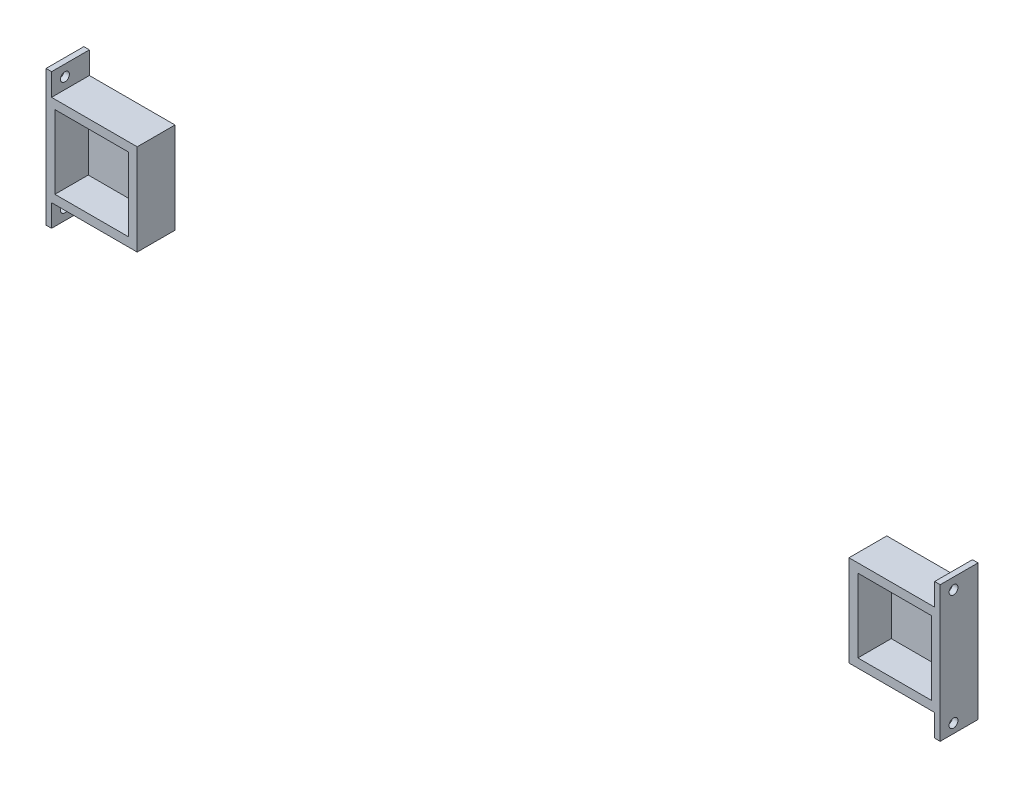
ISO-10303-21;
HEADER;
FILE_DESCRIPTION(('STEP AP214'),'2;1');
FILE_NAME('part.step','',(''),(''),'','','');
FILE_SCHEMA(('AUTOMOTIVE_DESIGN { 1 0 10303 214 1 1 1 1 }'));
ENDSEC;
DATA;
#1=APPLICATION_CONTEXT('core data for automotive mechanical design processes');
#2=APPLICATION_PROTOCOL_DEFINITION('international standard','automotive_design',2000,#1);
#3=PRODUCT_CONTEXT('',#1,'mechanical');
#4=PRODUCT('Part','Part','',(#3));
#5=PRODUCT_RELATED_PRODUCT_CATEGORY('part','',(#4));
#6=PRODUCT_DEFINITION_FORMATION('','',#4);
#7=PRODUCT_DEFINITION_CONTEXT('part definition',#1,'design');
#8=PRODUCT_DEFINITION('design','',#6,#7);
#9=PRODUCT_DEFINITION_SHAPE('','',#8);
#10=(LENGTH_UNIT() NAMED_UNIT(*) SI_UNIT(.MILLI.,.METRE.));
#11=(NAMED_UNIT(*) PLANE_ANGLE_UNIT() SI_UNIT($,.RADIAN.));
#12=(NAMED_UNIT(*) SI_UNIT($,.STERADIAN.) SOLID_ANGLE_UNIT());
#13=UNCERTAINTY_MEASURE_WITH_UNIT(LENGTH_MEASURE(1.E-05),#10,'distance_accuracy_value','');
#14=(GEOMETRIC_REPRESENTATION_CONTEXT(3) GLOBAL_UNCERTAINTY_ASSIGNED_CONTEXT((#13)) GLOBAL_UNIT_ASSIGNED_CONTEXT((#10,
#11,#12)) REPRESENTATION_CONTEXT('',''));
#15=CARTESIAN_POINT('',(0.,0.,0.));
#16=DIRECTION('',(0.,0.,1.));
#17=DIRECTION('',(1.,0.,0.));
#18=AXIS2_PLACEMENT_3D('',#15,#16,#17);
#19=CARTESIAN_POINT('',(0.,0.,19.05));
#20=DIRECTION('',(0.,0.,1.));
#21=DIRECTION('',(1.,0.,0.));
#22=AXIS2_PLACEMENT_3D('',#19,#20,#21);
#23=PLANE('',#22);
#24=DIRECTION('',(0.,-1.,0.));
#25=VECTOR('',#24,1.);
#26=CARTESIAN_POINT('',(453.39,46.9900000000001,19.05));
#27=LINE('',#26,#25);
#28=CARTESIAN_POINT('',(453.39,46.9900000000001,19.05));
#29=VERTEX_POINT('',#28);
#30=CARTESIAN_POINT('',(453.39,-5.07999999999991,19.05));
#31=VERTEX_POINT('',#30);
#32=EDGE_CURVE('E176',#29,#31,#27,.T.);
#33=ORIENTED_EDGE('',*,*,#32,.T.);
#34=DIRECTION('',(1.,0.,0.));
#35=VECTOR('',#34,1.);
#36=CARTESIAN_POINT('',(453.39,-5.07999999999991,19.05));
#37=LINE('',#36,#35);
#38=CARTESIAN_POINT('',(502.285,-5.07999999999991,19.05));
#39=VERTEX_POINT('',#38);
#40=EDGE_CURVE('E170',#31,#39,#37,.T.);
#41=ORIENTED_EDGE('',*,*,#40,.T.);
#42=DIRECTION('',(0.,-1.,0.));
#43=VECTOR('',#42,1.);
#44=CARTESIAN_POINT('',(502.285,-5.07999999999991,19.05));
#45=LINE('',#44,#43);
#46=CARTESIAN_POINT('',(502.285,-17.78,19.05));
#47=VERTEX_POINT('',#46);
#48=EDGE_CURVE('E75',#39,#47,#45,.T.);
#49=ORIENTED_EDGE('',*,*,#48,.T.);
#50=DIRECTION('',(1.,0.,0.));
#51=VECTOR('',#50,1.);
#52=CARTESIAN_POINT('',(502.285,-17.78,19.05));
#53=LINE('',#52,#51);
#54=CARTESIAN_POINT('',(505.46,-17.78,19.05));
#55=VERTEX_POINT('',#54);
#56=EDGE_CURVE('E235',#47,#55,#53,.T.);
#57=ORIENTED_EDGE('',*,*,#56,.T.);
#58=DIRECTION('',(0.,1.,0.));
#59=VECTOR('',#58,1.);
#60=CARTESIAN_POINT('',(505.46,46.9900000000001,19.05));
#61=LINE('',#60,#59);
#62=CARTESIAN_POINT('',(505.46,59.69,19.05));
#63=VERTEX_POINT('',#62);
#64=EDGE_CURVE('E166',#55,#63,#61,.T.);
#65=ORIENTED_EDGE('',*,*,#64,.T.);
#66=DIRECTION('',(1.,0.,0.));
#67=VECTOR('',#66,1.);
#68=CARTESIAN_POINT('',(502.285,59.69,19.05));
#69=LINE('',#68,#67);
#70=CARTESIAN_POINT('',(502.285,59.69,19.05));
#71=VERTEX_POINT('',#70);
#72=EDGE_CURVE('E159',#71,#63,#69,.T.);
#73=ORIENTED_EDGE('',*,*,#72,.F.);
#74=DIRECTION('',(0.,-1.,0.));
#75=VECTOR('',#74,1.);
#76=CARTESIAN_POINT('',(502.285,46.9900000000001,19.05));
#77=LINE('',#76,#75);
#78=CARTESIAN_POINT('',(502.285,46.9900000000001,19.05));
#79=VERTEX_POINT('',#78);
#80=EDGE_CURVE('E145',#71,#79,#77,.T.);
#81=ORIENTED_EDGE('',*,*,#80,.T.);
#82=DIRECTION('',(-1.,0.,0.));
#83=VECTOR('',#82,1.);
#84=CARTESIAN_POINT('',(453.39,46.9900000000001,19.05));
#85=LINE('',#84,#83);
#86=EDGE_CURVE('E156',#79,#29,#85,.T.);
#87=ORIENTED_EDGE('',*,*,#86,.T.);
#88=EDGE_LOOP('',(#33,#41,#49,#57,#65,#73,#81,#87));
#89=FACE_BOUND('',#88,.T.);
#90=DIRECTION('',(1.,0.,0.));
#91=VECTOR('',#90,1.);
#92=CARTESIAN_POINT('',(458.47,1.2490009027033E-13,19.05));
#93=LINE('',#92,#91);
#94=CARTESIAN_POINT('',(458.47,1.2490009027033E-13,19.05));
#95=VERTEX_POINT('',#94);
#96=CARTESIAN_POINT('',(500.38,1.21430643318376E-13,19.05));
#97=VERTEX_POINT('',#96);
#98=EDGE_CURVE('E217',#95,#97,#93,.T.);
#99=ORIENTED_EDGE('',*,*,#98,.F.);
#100=DIRECTION('',(0.,-1.,0.));
#101=VECTOR('',#100,1.);
#102=CARTESIAN_POINT('',(458.47,41.9100000000001,19.05));
#103=LINE('',#102,#101);
#104=CARTESIAN_POINT('',(458.47,41.9100000000001,19.05));
#105=VERTEX_POINT('',#104);
#106=EDGE_CURVE('E197',#105,#95,#103,.T.);
#107=ORIENTED_EDGE('',*,*,#106,.F.);
#108=DIRECTION('',(-1.,0.,0.));
#109=VECTOR('',#108,1.);
#110=CARTESIAN_POINT('',(458.47,41.9100000000001,19.05));
#111=LINE('',#110,#109);
#112=CARTESIAN_POINT('',(500.38,41.9100000000001,19.05));
#113=VERTEX_POINT('',#112);
#114=EDGE_CURVE('E192',#113,#105,#111,.T.);
#115=ORIENTED_EDGE('',*,*,#114,.F.);
#116=DIRECTION('',(0.,1.,0.));
#117=VECTOR('',#116,1.);
#118=CARTESIAN_POINT('',(500.38,41.9100000000001,19.05));
#119=LINE('',#118,#117);
#120=EDGE_CURVE('E213',#97,#113,#119,.T.);
#121=ORIENTED_EDGE('',*,*,#120,.F.);
#122=EDGE_LOOP('',(#99,#107,#115,#121));
#123=FACE_BOUND('',#122,.T.);
#124=ADVANCED_FACE('F51',(#89,#123),#23,.T.);
#125=CARTESIAN_POINT('',(453.39,46.9900000000001,19.05));
#126=DIRECTION('',(1.,0.,0.));
#127=DIRECTION('',(0.,1.,0.));
#128=AXIS2_PLACEMENT_3D('',#125,#126,#127);
#129=PLANE('',#128);
#130=DIRECTION('',(0.,0.,-1.));
#131=VECTOR('',#130,1.);
#132=CARTESIAN_POINT('',(453.39,46.9900000000001,19.05));
#133=LINE('',#132,#131);
#134=CARTESIAN_POINT('',(453.39,46.9900000000001,-2.54));
#135=VERTEX_POINT('',#134);
#136=EDGE_CURVE('E60',#29,#135,#133,.T.);
#137=ORIENTED_EDGE('',*,*,#136,.T.);
#138=DIRECTION('',(0.,1.,0.));
#139=VECTOR('',#138,1.);
#140=CARTESIAN_POINT('',(453.39,-5.07999999999991,-2.54));
#141=LINE('',#140,#139);
#142=CARTESIAN_POINT('',(453.39,-5.07999999999991,-2.54));
#143=VERTEX_POINT('',#142);
#144=EDGE_CURVE('E230',#143,#135,#141,.T.);
#145=ORIENTED_EDGE('',*,*,#144,.F.);
#146=DIRECTION('',(0.,0.,-1.));
#147=VECTOR('',#146,1.);
#148=CARTESIAN_POINT('',(453.39,-5.07999999999991,19.05));
#149=LINE('',#148,#147);
#150=EDGE_CURVE('E12',#31,#143,#149,.T.);
#151=ORIENTED_EDGE('',*,*,#150,.F.);
#152=ORIENTED_EDGE('',*,*,#32,.F.);
#153=EDGE_LOOP('',(#137,#145,#151,#152));
#154=FACE_BOUND('',#153,.T.);
#155=ADVANCED_FACE('F53',(#154),#129,.F.);
#156=CARTESIAN_POINT('',(453.39,-5.07999999999991,19.05));
#157=DIRECTION('',(0.,1.,0.));
#158=DIRECTION('',(0.,0.,1.));
#159=AXIS2_PLACEMENT_3D('',#156,#157,#158);
#160=PLANE('',#159);
#161=DIRECTION('',(-1.,0.,0.));
#162=VECTOR('',#161,1.);
#163=CARTESIAN_POINT('',(453.39,-5.07999999999991,-2.54));
#164=LINE('',#163,#162);
#165=CARTESIAN_POINT('',(502.285,-5.07999999999991,-2.54));
#166=VERTEX_POINT('',#165);
#167=EDGE_CURVE('E210',#166,#143,#164,.T.);
#168=ORIENTED_EDGE('',*,*,#167,.F.);
#169=DIRECTION('',(0.,0.,1.));
#170=VECTOR('',#169,1.);
#171=CARTESIAN_POINT('',(502.285,-5.07999999999991,19.05));
#172=LINE('',#171,#170);
#173=EDGE_CURVE('E239',#166,#39,#172,.T.);
#174=ORIENTED_EDGE('',*,*,#173,.T.);
#175=ORIENTED_EDGE('',*,*,#40,.F.);
#176=ORIENTED_EDGE('',*,*,#150,.T.);
#177=EDGE_LOOP('',(#168,#174,#175,#176));
#178=FACE_BOUND('',#177,.T.);
#179=ADVANCED_FACE('F298',(#178),#160,.F.);
#180=CARTESIAN_POINT('',(505.46,46.9900000000001,19.05));
#181=DIRECTION('',(-1.,0.,0.));
#182=DIRECTION('',(0.,0.,1.));
#183=AXIS2_PLACEMENT_3D('',#180,#181,#182);
#184=PLANE('',#183);
#185=ORIENTED_EDGE('',*,*,#64,.F.);
#186=DIRECTION('',(0.,0.,-1.));
#187=VECTOR('',#186,1.);
#188=CARTESIAN_POINT('',(505.46,-17.78,19.05));
#189=LINE('',#188,#187);
#190=CARTESIAN_POINT('',(505.46,-17.78,-2.54));
#191=VERTEX_POINT('',#190);
#192=EDGE_CURVE('E243',#55,#191,#189,.T.);
#193=ORIENTED_EDGE('',*,*,#192,.T.);
#194=DIRECTION('',(0.,-1.,0.));
#195=VECTOR('',#194,1.);
#196=CARTESIAN_POINT('',(505.46,-5.07999999999992,-2.54));
#197=LINE('',#196,#195);
#198=CARTESIAN_POINT('',(505.46,59.69,-2.54));
#199=VERTEX_POINT('',#198);
#200=EDGE_CURVE('E224',#199,#191,#197,.T.);
#201=ORIENTED_EDGE('',*,*,#200,.F.);
#202=DIRECTION('',(0.,0.,1.));
#203=VECTOR('',#202,1.);
#204=CARTESIAN_POINT('',(505.46,59.69,19.05));
#205=LINE('',#204,#203);
#206=EDGE_CURVE('E161',#199,#63,#205,.T.);
#207=ORIENTED_EDGE('',*,*,#206,.T.);
#208=EDGE_LOOP('',(#185,#193,#201,#207));
#209=FACE_BOUND('',#208,.T.);
#210=CARTESIAN_POINT('',(505.46,-12.5092135661895,11.43));
#211=DIRECTION('',(1.,0.,0.));
#212=DIRECTION('',(0.,0.,-1.));
#213=AXIS2_PLACEMENT_3D('',#210,#211,#212);
#214=CIRCLE('',#213,2.54);
#215=CARTESIAN_POINT('',(505.46,-12.5092135661895,8.89));
#216=VERTEX_POINT('',#215);
#217=EDGE_CURVE('E259',#216,#216,#214,.T.);
#218=ORIENTED_EDGE('',*,*,#217,.F.);
#219=EDGE_LOOP('',(#218));
#220=FACE_BOUND('',#219,.T.);
#221=CARTESIAN_POINT('',(505.46,53.34,11.43));
#222=DIRECTION('',(1.,0.,0.));
#223=DIRECTION('',(0.,0.,-1.));
#224=AXIS2_PLACEMENT_3D('',#221,#222,#223);
#225=CIRCLE('',#224,2.54);
#226=CARTESIAN_POINT('',(505.46,53.34,8.89));
#227=VERTEX_POINT('',#226);
#228=EDGE_CURVE('E281',#227,#227,#225,.T.);
#229=ORIENTED_EDGE('',*,*,#228,.F.);
#230=EDGE_LOOP('',(#229));
#231=FACE_BOUND('',#230,.T.);
#232=ADVANCED_FACE('F296',(#209,#220,#231),#184,.F.);
#233=CARTESIAN_POINT('',(453.39,46.9900000000001,19.05));
#234=DIRECTION('',(0.,-1.,0.));
#235=DIRECTION('',(0.,0.,-1.));
#236=AXIS2_PLACEMENT_3D('',#233,#234,#235);
#237=PLANE('',#236);
#238=ORIENTED_EDGE('',*,*,#86,.F.);
#239=DIRECTION('',(0.,0.,-1.));
#240=VECTOR('',#239,1.);
#241=CARTESIAN_POINT('',(502.285,46.9900000000001,19.05));
#242=LINE('',#241,#240);
#243=CARTESIAN_POINT('',(502.285,46.9900000000001,-2.54));
#244=VERTEX_POINT('',#243);
#245=EDGE_CURVE('E142',#79,#244,#242,.T.);
#246=ORIENTED_EDGE('',*,*,#245,.T.);
#247=DIRECTION('',(1.,0.,0.));
#248=VECTOR('',#247,1.);
#249=CARTESIAN_POINT('',(453.39,46.9900000000001,-2.54));
#250=LINE('',#249,#248);
#251=EDGE_CURVE('E227',#135,#244,#250,.T.);
#252=ORIENTED_EDGE('',*,*,#251,.F.);
#253=ORIENTED_EDGE('',*,*,#136,.F.);
#254=EDGE_LOOP('',(#238,#246,#252,#253));
#255=FACE_BOUND('',#254,.T.);
#256=ADVANCED_FACE('F163',(#255),#237,.F.);
#257=CARTESIAN_POINT('',(458.47,41.9100000000001,19.05));
#258=DIRECTION('',(1.,0.,0.));
#259=DIRECTION('',(0.,0.,-1.));
#260=AXIS2_PLACEMENT_3D('',#257,#258,#259);
#261=PLANE('',#260);
#262=DIRECTION('',(0.,-1.,0.));
#263=VECTOR('',#262,1.);
#264=CARTESIAN_POINT('',(458.47,41.9100000000001,0.));
#265=LINE('',#264,#263);
#266=CARTESIAN_POINT('',(458.47,41.9100000000001,0.));
#267=VERTEX_POINT('',#266);
#268=CARTESIAN_POINT('',(458.47,1.2490009027033E-13,0.));
#269=VERTEX_POINT('',#268);
#270=EDGE_CURVE('E206',#267,#269,#265,.T.);
#271=ORIENTED_EDGE('',*,*,#270,.F.);
#272=DIRECTION('',(0.,0.,-1.));
#273=VECTOR('',#272,1.);
#274=CARTESIAN_POINT('',(458.47,41.9100000000001,19.05));
#275=LINE('',#274,#273);
#276=EDGE_CURVE('E189',#105,#267,#275,.T.);
#277=ORIENTED_EDGE('',*,*,#276,.F.);
#278=ORIENTED_EDGE('',*,*,#106,.T.);
#279=DIRECTION('',(0.,0.,-1.));
#280=VECTOR('',#279,1.);
#281=CARTESIAN_POINT('',(458.47,1.2490009027033E-13,19.05));
#282=LINE('',#281,#280);
#283=EDGE_CURVE('E179',#95,#269,#282,.T.);
#284=ORIENTED_EDGE('',*,*,#283,.T.);
#285=EDGE_LOOP('',(#271,#277,#278,#284));
#286=FACE_BOUND('',#285,.T.);
#287=ADVANCED_FACE('F305',(#286),#261,.T.);
#288=CARTESIAN_POINT('',(458.47,1.2490009027033E-13,19.05));
#289=DIRECTION('',(0.,1.,0.));
#290=DIRECTION('',(-1.,0.,0.));
#291=AXIS2_PLACEMENT_3D('',#288,#289,#290);
#292=PLANE('',#291);
#293=DIRECTION('',(1.,0.,0.));
#294=VECTOR('',#293,1.);
#295=CARTESIAN_POINT('',(458.47,1.2490009027033E-13,0.));
#296=LINE('',#295,#294);
#297=CARTESIAN_POINT('',(500.38,1.21430643318376E-13,0.));
#298=VERTEX_POINT('',#297);
#299=EDGE_CURVE('E202',#269,#298,#296,.T.);
#300=ORIENTED_EDGE('',*,*,#299,.F.);
#301=ORIENTED_EDGE('',*,*,#283,.F.);
#302=ORIENTED_EDGE('',*,*,#98,.T.);
#303=DIRECTION('',(0.,0.,-1.));
#304=VECTOR('',#303,1.);
#305=CARTESIAN_POINT('',(500.38,1.21430643318376E-13,19.05));
#306=LINE('',#305,#304);
#307=EDGE_CURVE('E183',#97,#298,#306,.T.);
#308=ORIENTED_EDGE('',*,*,#307,.T.);
#309=EDGE_LOOP('',(#300,#301,#302,#308));
#310=FACE_BOUND('',#309,.T.);
#311=ADVANCED_FACE('F318',(#310),#292,.T.);
#312=CARTESIAN_POINT('',(500.38,41.9100000000001,19.05));
#313=DIRECTION('',(-1.,0.,0.));
#314=DIRECTION('',(0.,0.,1.));
#315=AXIS2_PLACEMENT_3D('',#312,#313,#314);
#316=PLANE('',#315);
#317=DIRECTION('',(0.,1.,0.));
#318=VECTOR('',#317,1.);
#319=CARTESIAN_POINT('',(500.38,41.9100000000001,0.));
#320=LINE('',#319,#318);
#321=CARTESIAN_POINT('',(500.38,41.9100000000001,0.));
#322=VERTEX_POINT('',#321);
#323=EDGE_CURVE('E198',#298,#322,#320,.T.);
#324=ORIENTED_EDGE('',*,*,#323,.F.);
#325=ORIENTED_EDGE('',*,*,#307,.F.);
#326=ORIENTED_EDGE('',*,*,#120,.T.);
#327=DIRECTION('',(0.,0.,-1.));
#328=VECTOR('',#327,1.);
#329=CARTESIAN_POINT('',(500.38,41.9100000000001,19.05));
#330=LINE('',#329,#328);
#331=EDGE_CURVE('E186',#113,#322,#330,.T.);
#332=ORIENTED_EDGE('',*,*,#331,.T.);
#333=EDGE_LOOP('',(#324,#325,#326,#332));
#334=FACE_BOUND('',#333,.T.);
#335=ADVANCED_FACE('F322',(#334),#316,.T.);
#336=CARTESIAN_POINT('',(458.47,41.9100000000001,19.05));
#337=DIRECTION('',(0.,-1.,0.));
#338=DIRECTION('',(1.,0.,0.));
#339=AXIS2_PLACEMENT_3D('',#336,#337,#338);
#340=PLANE('',#339);
#341=DIRECTION('',(-1.,0.,0.));
#342=VECTOR('',#341,1.);
#343=CARTESIAN_POINT('',(458.47,41.9100000000001,0.));
#344=LINE('',#343,#342);
#345=EDGE_CURVE('E193',#322,#267,#344,.T.);
#346=ORIENTED_EDGE('',*,*,#345,.F.);
#347=ORIENTED_EDGE('',*,*,#331,.F.);
#348=ORIENTED_EDGE('',*,*,#114,.T.);
#349=ORIENTED_EDGE('',*,*,#276,.T.);
#350=EDGE_LOOP('',(#346,#347,#348,#349));
#351=FACE_BOUND('',#350,.T.);
#352=ADVANCED_FACE('F326',(#351),#340,.T.);
#353=CARTESIAN_POINT('',(0.,0.,0.));
#354=DIRECTION('',(0.,0.,-1.));
#355=DIRECTION('',(-1.,0.,0.));
#356=AXIS2_PLACEMENT_3D('',#353,#354,#355);
#357=PLANE('',#356);
#358=ORIENTED_EDGE('',*,*,#345,.T.);
#359=ORIENTED_EDGE('',*,*,#270,.T.);
#360=ORIENTED_EDGE('',*,*,#299,.T.);
#361=ORIENTED_EDGE('',*,*,#323,.T.);
#362=EDGE_LOOP('',(#358,#359,#360,#361));
#363=FACE_BOUND('',#362,.T.);
#364=ADVANCED_FACE('F330',(#363),#357,.F.);
#365=CARTESIAN_POINT('',(0.,0.,-2.54));
#366=DIRECTION('',(0.,0.,-1.));
#367=DIRECTION('',(-1.,0.,0.));
#368=AXIS2_PLACEMENT_3D('',#365,#366,#367);
#369=PLANE('',#368);
#370=ORIENTED_EDGE('',*,*,#144,.T.);
#371=ORIENTED_EDGE('',*,*,#251,.T.);
#372=DIRECTION('',(0.,1.,0.));
#373=VECTOR('',#372,1.);
#374=CARTESIAN_POINT('',(502.285,46.9900000000001,-2.54));
#375=LINE('',#374,#373);
#376=CARTESIAN_POINT('',(502.285,59.69,-2.54));
#377=VERTEX_POINT('',#376);
#378=EDGE_CURVE('E67',#244,#377,#375,.T.);
#379=ORIENTED_EDGE('',*,*,#378,.T.);
#380=DIRECTION('',(1.,0.,0.));
#381=VECTOR('',#380,1.);
#382=CARTESIAN_POINT('',(502.285,59.69,-2.54));
#383=LINE('',#382,#381);
#384=EDGE_CURVE('E266',#377,#199,#383,.T.);
#385=ORIENTED_EDGE('',*,*,#384,.T.);
#386=ORIENTED_EDGE('',*,*,#200,.T.);
#387=DIRECTION('',(1.,0.,0.));
#388=VECTOR('',#387,1.);
#389=CARTESIAN_POINT('',(502.285,-17.78,-2.54));
#390=LINE('',#389,#388);
#391=CARTESIAN_POINT('',(502.285,-17.78,-2.54));
#392=VERTEX_POINT('',#391);
#393=EDGE_CURVE('E234',#392,#191,#390,.T.);
#394=ORIENTED_EDGE('',*,*,#393,.F.);
#395=DIRECTION('',(0.,1.,0.));
#396=VECTOR('',#395,1.);
#397=CARTESIAN_POINT('',(502.285,-5.07999999999991,-2.54));
#398=LINE('',#397,#396);
#399=EDGE_CURVE('E250',#392,#166,#398,.T.);
#400=ORIENTED_EDGE('',*,*,#399,.T.);
#401=ORIENTED_EDGE('',*,*,#167,.T.);
#402=EDGE_LOOP('',(#370,#371,#379,#385,#386,#394,#400,#401));
#403=FACE_BOUND('',#402,.T.);
#404=ADVANCED_FACE('F334',(#403),#369,.T.);
#405=CARTESIAN_POINT('',(502.285,-17.78,19.05));
#406=DIRECTION('',(0.,-1.,0.));
#407=DIRECTION('',(0.,0.,-1.));
#408=AXIS2_PLACEMENT_3D('',#405,#406,#407);
#409=PLANE('',#408);
#410=ORIENTED_EDGE('',*,*,#192,.F.);
#411=ORIENTED_EDGE('',*,*,#56,.F.);
#412=DIRECTION('',(0.,0.,-1.));
#413=VECTOR('',#412,1.);
#414=CARTESIAN_POINT('',(502.285,-17.78,19.05));
#415=LINE('',#414,#413);
#416=EDGE_CURVE('E253',#47,#392,#415,.T.);
#417=ORIENTED_EDGE('',*,*,#416,.T.);
#418=ORIENTED_EDGE('',*,*,#393,.T.);
#419=EDGE_LOOP('',(#410,#411,#417,#418));
#420=FACE_BOUND('',#419,.T.);
#421=ADVANCED_FACE('F338',(#420),#409,.T.);
#422=CARTESIAN_POINT('',(502.285,0.,0.));
#423=DIRECTION('',(1.,0.,0.));
#424=DIRECTION('',(0.,0.,-1.));
#425=AXIS2_PLACEMENT_3D('',#422,#423,#424);
#426=PLANE('',#425);
#427=CARTESIAN_POINT('',(502.285,-12.5092135661895,11.43));
#428=DIRECTION('',(1.,0.,0.));
#429=DIRECTION('',(0.,0.,-1.));
#430=AXIS2_PLACEMENT_3D('',#427,#428,#429);
#431=CIRCLE('',#430,2.54);
#432=CARTESIAN_POINT('',(502.285,-12.5092135661895,8.89));
#433=VERTEX_POINT('',#432);
#434=EDGE_CURVE('E247',#433,#433,#431,.T.);
#435=ORIENTED_EDGE('',*,*,#434,.T.);
#436=EDGE_LOOP('',(#435));
#437=FACE_BOUND('',#436,.T.);
#438=ORIENTED_EDGE('',*,*,#48,.F.);
#439=ORIENTED_EDGE('',*,*,#173,.F.);
#440=ORIENTED_EDGE('',*,*,#399,.F.);
#441=ORIENTED_EDGE('',*,*,#416,.F.);
#442=EDGE_LOOP('',(#438,#439,#440,#441));
#443=FACE_BOUND('',#442,.T.);
#444=ADVANCED_FACE('F342',(#437,#443),#426,.F.);
#445=CARTESIAN_POINT('',(502.285,-12.5092135661895,11.43));
#446=DIRECTION('',(1.,0.,0.));
#447=DIRECTION('',(0.,0.,-1.));
#448=AXIS2_PLACEMENT_3D('',#445,#446,#447);
#449=CYLINDRICAL_SURFACE('',#448,2.54);
#450=ORIENTED_EDGE('',*,*,#434,.F.);
#451=EDGE_LOOP('',(#450));
#452=FACE_BOUND('',#451,.T.);
#453=ORIENTED_EDGE('',*,*,#217,.T.);
#454=EDGE_LOOP('',(#453));
#455=FACE_BOUND('',#454,.T.);
#456=ADVANCED_FACE('F346',(#452,#455),#449,.F.);
#457=CARTESIAN_POINT('',(502.285,59.69,19.05));
#458=DIRECTION('',(0.,1.,0.));
#459=DIRECTION('',(0.,0.,1.));
#460=AXIS2_PLACEMENT_3D('',#457,#458,#459);
#461=PLANE('',#460);
#462=ORIENTED_EDGE('',*,*,#206,.F.);
#463=ORIENTED_EDGE('',*,*,#384,.F.);
#464=DIRECTION('',(0.,0.,1.));
#465=VECTOR('',#464,1.);
#466=CARTESIAN_POINT('',(502.285,59.69,19.05));
#467=LINE('',#466,#465);
#468=EDGE_CURVE('E270',#377,#71,#467,.T.);
#469=ORIENTED_EDGE('',*,*,#468,.T.);
#470=ORIENTED_EDGE('',*,*,#72,.T.);
#471=EDGE_LOOP('',(#462,#463,#469,#470));
#472=FACE_BOUND('',#471,.T.);
#473=ADVANCED_FACE('F350',(#472),#461,.T.);
#474=CARTESIAN_POINT('',(502.285,0.,0.));
#475=DIRECTION('',(-1.,0.,0.));
#476=DIRECTION('',(0.,0.,1.));
#477=AXIS2_PLACEMENT_3D('',#474,#475,#476);
#478=PLANE('',#477);
#479=CARTESIAN_POINT('',(502.285,53.34,11.43));
#480=DIRECTION('',(1.,0.,0.));
#481=DIRECTION('',(0.,0.,-1.));
#482=AXIS2_PLACEMENT_3D('',#479,#480,#481);
#483=CIRCLE('',#482,2.54);
#484=CARTESIAN_POINT('',(502.285,53.34,8.89));
#485=VERTEX_POINT('',#484);
#486=EDGE_CURVE('E276',#485,#485,#483,.T.);
#487=ORIENTED_EDGE('',*,*,#486,.T.);
#488=EDGE_LOOP('',(#487));
#489=FACE_BOUND('',#488,.T.);
#490=ORIENTED_EDGE('',*,*,#80,.F.);
#491=ORIENTED_EDGE('',*,*,#468,.F.);
#492=ORIENTED_EDGE('',*,*,#378,.F.);
#493=ORIENTED_EDGE('',*,*,#245,.F.);
#494=EDGE_LOOP('',(#490,#491,#492,#493));
#495=FACE_BOUND('',#494,.T.);
#496=ADVANCED_FACE('F144',(#489,#495),#478,.T.);
#497=CARTESIAN_POINT('',(502.285,53.34,11.43));
#498=DIRECTION('',(1.,0.,0.));
#499=DIRECTION('',(0.,0.,-1.));
#500=AXIS2_PLACEMENT_3D('',#497,#498,#499);
#501=CYLINDRICAL_SURFACE('',#500,2.54);
#502=ORIENTED_EDGE('',*,*,#486,.F.);
#503=EDGE_LOOP('',(#502));
#504=FACE_BOUND('',#503,.T.);
#505=ORIENTED_EDGE('',*,*,#228,.T.);
#506=EDGE_LOOP('',(#505));
#507=FACE_BOUND('',#506,.T.);
#508=ADVANCED_FACE('F290',(#504,#507),#501,.F.);
#509=CLOSED_SHELL('',(#124,#155,#179,#232,#256,#287,#311,#335,#352,#364,#404,#421,#444,#456,
#473,#496,#508));
#510=MANIFOLD_SOLID_BREP('B2',#509);
#511=CARTESIAN_POINT('',(0.,0.,19.05));
#512=DIRECTION('',(0.,0.,1.));
#513=DIRECTION('',(1.,0.,0.));
#514=AXIS2_PLACEMENT_3D('',#511,#512,#513);
#515=PLANE('',#514);
#516=DIRECTION('',(0.,-1.,0.));
#517=VECTOR('',#516,1.);
#518=CARTESIAN_POINT('',(-5.08,46.99,19.05));
#519=LINE('',#518,#517);
#520=CARTESIAN_POINT('',(-5.08,59.69,19.05));
#521=VERTEX_POINT('',#520);
#522=CARTESIAN_POINT('',(-5.07999999999999,-17.78,19.05));
#523=VERTEX_POINT('',#522);
#524=EDGE_CURVE('E690',#521,#523,#519,.T.);
#525=ORIENTED_EDGE('',*,*,#524,.T.);
#526=DIRECTION('',(-1.,0.,0.));
#527=VECTOR('',#526,1.);
#528=CARTESIAN_POINT('',(-1.90499999999999,-17.78,19.05));
#529=LINE('',#528,#527);
#530=CARTESIAN_POINT('',(-1.90499999999999,-17.78,19.05));
#531=VERTEX_POINT('',#530);
#532=EDGE_CURVE('E645',#531,#523,#529,.T.);
#533=ORIENTED_EDGE('',*,*,#532,.F.);
#534=DIRECTION('',(0.,1.,0.));
#535=VECTOR('',#534,1.);
#536=CARTESIAN_POINT('',(-1.90499999999999,-5.08,19.05));
#537=LINE('',#536,#535);
#538=CARTESIAN_POINT('',(-1.90499999999999,-5.08,19.05));
#539=VERTEX_POINT('',#538);
#540=EDGE_CURVE('E633',#531,#539,#537,.T.);
#541=ORIENTED_EDGE('',*,*,#540,.T.);
#542=DIRECTION('',(1.,0.,0.));
#543=VECTOR('',#542,1.);
#544=CARTESIAN_POINT('',(-5.07999999999999,-5.08,19.05));
#545=LINE('',#544,#543);
#546=CARTESIAN_POINT('',(46.99,-5.08,19.05));
#547=VERTEX_POINT('',#546);
#548=EDGE_CURVE('E692',#539,#547,#545,.T.);
#549=ORIENTED_EDGE('',*,*,#548,.T.);
#550=DIRECTION('',(0.,1.,0.));
#551=VECTOR('',#550,1.);
#552=CARTESIAN_POINT('',(46.99,46.99,19.05));
#553=LINE('',#552,#551);
#554=CARTESIAN_POINT('',(46.99,46.99,19.05));
#555=VERTEX_POINT('',#554);
#556=EDGE_CURVE('E694',#547,#555,#553,.T.);
#557=ORIENTED_EDGE('',*,*,#556,.T.);
#558=DIRECTION('',(-1.,0.,0.));
#559=VECTOR('',#558,1.);
#560=CARTESIAN_POINT('',(-5.08,46.99,19.05));
#561=LINE('',#560,#559);
#562=CARTESIAN_POINT('',(-1.905,46.99,19.05));
#563=VERTEX_POINT('',#562);
#564=EDGE_CURVE('E615',#555,#563,#561,.T.);
#565=ORIENTED_EDGE('',*,*,#564,.T.);
#566=DIRECTION('',(0.,1.,0.));
#567=VECTOR('',#566,1.);
#568=CARTESIAN_POINT('',(-1.905,46.99,19.05));
#569=LINE('',#568,#567);
#570=CARTESIAN_POINT('',(-1.905,59.69,19.05));
#571=VERTEX_POINT('',#570);
#572=EDGE_CURVE('E521',#563,#571,#569,.T.);
#573=ORIENTED_EDGE('',*,*,#572,.T.);
#574=DIRECTION('',(-1.,0.,0.));
#575=VECTOR('',#574,1.);
#576=CARTESIAN_POINT('',(-1.905,59.69,19.05));
#577=LINE('',#576,#575);
#578=EDGE_CURVE('E598',#571,#521,#577,.T.);
#579=ORIENTED_EDGE('',*,*,#578,.T.);
#580=EDGE_LOOP('',(#525,#533,#541,#549,#557,#565,#573,#579));
#581=FACE_BOUND('',#580,.T.);
#582=DIRECTION('',(1.,0.,0.));
#583=VECTOR('',#582,1.);
#584=CARTESIAN_POINT('',(0.,0.,19.05));
#585=LINE('',#584,#583);
#586=CARTESIAN_POINT('',(0.,0.,19.05));
#587=VERTEX_POINT('',#586);
#588=CARTESIAN_POINT('',(41.91,0.,19.05));
#589=VERTEX_POINT('',#588);
#590=EDGE_CURVE('E663',#587,#589,#585,.T.);
#591=ORIENTED_EDGE('',*,*,#590,.F.);
#592=DIRECTION('',(0.,-1.,0.));
#593=VECTOR('',#592,1.);
#594=CARTESIAN_POINT('',(0.,0.,19.05));
#595=LINE('',#594,#593);
#596=CARTESIAN_POINT('',(0.,41.91,19.05));
#597=VERTEX_POINT('',#596);
#598=EDGE_CURVE('E661',#597,#587,#595,.T.);
#599=ORIENTED_EDGE('',*,*,#598,.F.);
#600=DIRECTION('',(-1.,0.,0.));
#601=VECTOR('',#600,1.);
#602=CARTESIAN_POINT('',(0.,41.91,19.05));
#603=LINE('',#602,#601);
#604=CARTESIAN_POINT('',(41.91,41.91,19.05));
#605=VERTEX_POINT('',#604);
#606=EDGE_CURVE('E669',#605,#597,#603,.T.);
#607=ORIENTED_EDGE('',*,*,#606,.F.);
#608=DIRECTION('',(0.,1.,0.));
#609=VECTOR('',#608,1.);
#610=CARTESIAN_POINT('',(41.91,0.,19.05));
#611=LINE('',#610,#609);
#612=EDGE_CURVE('E666',#589,#605,#611,.T.);
#613=ORIENTED_EDGE('',*,*,#612,.F.);
#614=EDGE_LOOP('',(#591,#599,#607,#613));
#615=FACE_BOUND('',#614,.T.);
#616=ADVANCED_FACE('F506',(#581,#615),#515,.T.);
#617=CARTESIAN_POINT('',(-5.08,46.99,19.05));
#618=DIRECTION('',(1.,0.,0.));
#619=DIRECTION('',(0.,1.,0.));
#620=AXIS2_PLACEMENT_3D('',#617,#618,#619);
#621=PLANE('',#620);
#622=ORIENTED_EDGE('',*,*,#524,.F.);
#623=DIRECTION('',(0.,0.,-1.));
#624=VECTOR('',#623,1.);
#625=CARTESIAN_POINT('',(-5.08,59.69,19.05));
#626=LINE('',#625,#624);
#627=CARTESIAN_POINT('',(-5.08,59.69,-2.54));
#628=VERTEX_POINT('',#627);
#629=EDGE_CURVE('E603',#521,#628,#626,.T.);
#630=ORIENTED_EDGE('',*,*,#629,.T.);
#631=DIRECTION('',(0.,1.,0.));
#632=VECTOR('',#631,1.);
#633=CARTESIAN_POINT('',(-5.07999999999999,-5.08,-2.54));
#634=LINE('',#633,#632);
#635=CARTESIAN_POINT('',(-5.07999999999999,-17.78,-2.54));
#636=VERTEX_POINT('',#635);
#637=EDGE_CURVE('E648',#636,#628,#634,.T.);
#638=ORIENTED_EDGE('',*,*,#637,.F.);
#639=DIRECTION('',(0.,0.,1.));
#640=VECTOR('',#639,1.);
#641=CARTESIAN_POINT('',(-5.07999999999999,-17.78,19.05));
#642=LINE('',#641,#640);
#643=EDGE_CURVE('E630',#636,#523,#642,.T.);
#644=ORIENTED_EDGE('',*,*,#643,.T.);
#645=EDGE_LOOP('',(#622,#630,#638,#644));
#646=FACE_BOUND('',#645,.T.);
#647=CARTESIAN_POINT('',(-5.07999999999999,-11.43,11.43));
#648=DIRECTION('',(-1.,0.,0.));
#649=DIRECTION('',(0.,-1.,0.));
#650=AXIS2_PLACEMENT_3D('',#647,#648,#649);
#651=CIRCLE('',#650,2.54);
#652=CARTESIAN_POINT('',(-5.07999999999999,-13.97,11.43));
#653=VERTEX_POINT('',#652);
#654=EDGE_CURVE('E625',#653,#653,#651,.T.);
#655=ORIENTED_EDGE('',*,*,#654,.F.);
#656=EDGE_LOOP('',(#655));
#657=FACE_BOUND('',#656,.T.);
#658=CARTESIAN_POINT('',(-5.08,53.34,11.43));
#659=DIRECTION('',(-1.,0.,0.));
#660=DIRECTION('',(0.,-1.,0.));
#661=AXIS2_PLACEMENT_3D('',#658,#659,#660);
#662=CIRCLE('',#661,2.54);
#663=CARTESIAN_POINT('',(-5.08,50.8,11.43));
#664=VERTEX_POINT('',#663);
#665=EDGE_CURVE('E620',#664,#664,#662,.T.);
#666=ORIENTED_EDGE('',*,*,#665,.F.);
#667=EDGE_LOOP('',(#666));
#668=FACE_BOUND('',#667,.T.);
#669=ADVANCED_FACE('F508',(#646,#657,#668),#621,.F.);
#670=CARTESIAN_POINT('',(-5.07999999999999,-5.08,19.05));
#671=DIRECTION('',(0.,1.,0.));
#672=DIRECTION('',(0.,0.,1.));
#673=AXIS2_PLACEMENT_3D('',#670,#671,#672);
#674=PLANE('',#673);
#675=ORIENTED_EDGE('',*,*,#548,.F.);
#676=DIRECTION('',(0.,0.,-1.));
#677=VECTOR('',#676,1.);
#678=CARTESIAN_POINT('',(-1.90499999999999,-5.08,19.05));
#679=LINE('',#678,#677);
#680=CARTESIAN_POINT('',(-1.90499999999999,-5.08,-2.54));
#681=VERTEX_POINT('',#680);
#682=EDGE_CURVE('E636',#539,#681,#679,.T.);
#683=ORIENTED_EDGE('',*,*,#682,.T.);
#684=DIRECTION('',(-1.,0.,0.));
#685=VECTOR('',#684,1.);
#686=CARTESIAN_POINT('',(-5.07999999999999,-5.08,-2.54));
#687=LINE('',#686,#685);
#688=CARTESIAN_POINT('',(46.99,-5.08,-2.54));
#689=VERTEX_POINT('',#688);
#690=EDGE_CURVE('E657',#689,#681,#687,.T.);
#691=ORIENTED_EDGE('',*,*,#690,.F.);
#692=DIRECTION('',(0.,0.,-1.));
#693=VECTOR('',#692,1.);
#694=CARTESIAN_POINT('',(46.99,-5.08,19.05));
#695=LINE('',#694,#693);
#696=EDGE_CURVE('E49',#547,#689,#695,.T.);
#697=ORIENTED_EDGE('',*,*,#696,.F.);
#698=EDGE_LOOP('',(#675,#683,#691,#697));
#699=FACE_BOUND('',#698,.T.);
#700=ADVANCED_FACE('F711',(#699),#674,.F.);
#701=CARTESIAN_POINT('',(46.99,46.99,19.05));
#702=DIRECTION('',(-1.,0.,0.));
#703=DIRECTION('',(0.,-1.,0.));
#704=AXIS2_PLACEMENT_3D('',#701,#702,#703);
#705=PLANE('',#704);
#706=ORIENTED_EDGE('',*,*,#696,.T.);
#707=DIRECTION('',(0.,-1.,0.));
#708=VECTOR('',#707,1.);
#709=CARTESIAN_POINT('',(46.99,-5.08,-2.54));
#710=LINE('',#709,#708);
#711=CARTESIAN_POINT('',(46.99,46.99,-2.54));
#712=VERTEX_POINT('',#711);
#713=EDGE_CURVE('E654',#712,#689,#710,.T.);
#714=ORIENTED_EDGE('',*,*,#713,.F.);
#715=DIRECTION('',(0.,0.,-1.));
#716=VECTOR('',#715,1.);
#717=CARTESIAN_POINT('',(46.99,46.99,19.05));
#718=LINE('',#717,#716);
#719=EDGE_CURVE('E514',#555,#712,#718,.T.);
#720=ORIENTED_EDGE('',*,*,#719,.F.);
#721=ORIENTED_EDGE('',*,*,#556,.F.);
#722=EDGE_LOOP('',(#706,#714,#720,#721));
#723=FACE_BOUND('',#722,.T.);
#724=ADVANCED_FACE('F704',(#723),#705,.F.);
#725=CARTESIAN_POINT('',(-5.08,46.99,19.05));
#726=DIRECTION('',(0.,-1.,0.));
#727=DIRECTION('',(0.,0.,-1.));
#728=AXIS2_PLACEMENT_3D('',#725,#726,#727);
#729=PLANE('',#728);
#730=DIRECTION('',(1.,0.,0.));
#731=VECTOR('',#730,1.);
#732=CARTESIAN_POINT('',(-5.07999999999999,46.99,-2.54));
#733=LINE('',#732,#731);
#734=CARTESIAN_POINT('',(-1.905,46.99,-2.54));
#735=VERTEX_POINT('',#734);
#736=EDGE_CURVE('E652',#735,#712,#733,.T.);
#737=ORIENTED_EDGE('',*,*,#736,.F.);
#738=DIRECTION('',(0.,0.,1.));
#739=VECTOR('',#738,1.);
#740=CARTESIAN_POINT('',(-1.905,46.99,19.05));
#741=LINE('',#740,#739);
#742=EDGE_CURVE('E606',#735,#563,#741,.T.);
#743=ORIENTED_EDGE('',*,*,#742,.T.);
#744=ORIENTED_EDGE('',*,*,#564,.F.);
#745=ORIENTED_EDGE('',*,*,#719,.T.);
#746=EDGE_LOOP('',(#737,#743,#744,#745));
#747=FACE_BOUND('',#746,.T.);
#748=ADVANCED_FACE('F701',(#747),#729,.F.);
#749=CARTESIAN_POINT('',(0.,0.,19.05));
#750=DIRECTION('',(1.,0.,0.));
#751=DIRECTION('',(0.,0.,-1.));
#752=AXIS2_PLACEMENT_3D('',#749,#750,#751);
#753=PLANE('',#752);
#754=DIRECTION('',(0.,-1.,0.));
#755=VECTOR('',#754,1.);
#756=CARTESIAN_POINT('',(0.,0.,0.));
#757=LINE('',#756,#755);
#758=CARTESIAN_POINT('',(0.,41.91,0.));
#759=VERTEX_POINT('',#758);
#760=CARTESIAN_POINT('',(0.,0.,0.));
#761=VERTEX_POINT('',#760);
#762=EDGE_CURVE('E660',#759,#761,#757,.T.);
#763=ORIENTED_EDGE('',*,*,#762,.F.);
#764=DIRECTION('',(0.,0.,-1.));
#765=VECTOR('',#764,1.);
#766=CARTESIAN_POINT('',(0.,41.91,19.05));
#767=LINE('',#766,#765);
#768=EDGE_CURVE('E671',#597,#759,#767,.T.);
#769=ORIENTED_EDGE('',*,*,#768,.F.);
#770=ORIENTED_EDGE('',*,*,#598,.T.);
#771=DIRECTION('',(0.,0.,-1.));
#772=VECTOR('',#771,1.);
#773=CARTESIAN_POINT('',(0.,0.,19.05));
#774=LINE('',#773,#772);
#775=EDGE_CURVE('E687',#587,#761,#774,.T.);
#776=ORIENTED_EDGE('',*,*,#775,.T.);
#777=EDGE_LOOP('',(#763,#769,#770,#776));
#778=FACE_BOUND('',#777,.T.);
#779=ADVANCED_FACE('F742',(#778),#753,.T.);
#780=CARTESIAN_POINT('',(0.,0.,19.05));
#781=DIRECTION('',(0.,1.,0.));
#782=DIRECTION('',(0.,0.,1.));
#783=AXIS2_PLACEMENT_3D('',#780,#781,#782);
#784=PLANE('',#783);
#785=DIRECTION('',(1.,0.,0.));
#786=VECTOR('',#785,1.);
#787=CARTESIAN_POINT('',(0.,0.,0.));
#788=LINE('',#787,#786);
#789=CARTESIAN_POINT('',(41.91,0.,0.));
#790=VERTEX_POINT('',#789);
#791=EDGE_CURVE('E674',#761,#790,#788,.T.);
#792=ORIENTED_EDGE('',*,*,#791,.F.);
#793=ORIENTED_EDGE('',*,*,#775,.F.);
#794=ORIENTED_EDGE('',*,*,#590,.T.);
#795=DIRECTION('',(0.,0.,-1.));
#796=VECTOR('',#795,1.);
#797=CARTESIAN_POINT('',(41.91,0.,19.05));
#798=LINE('',#797,#796);
#799=EDGE_CURVE('E685',#589,#790,#798,.T.);
#800=ORIENTED_EDGE('',*,*,#799,.T.);
#801=EDGE_LOOP('',(#792,#793,#794,#800));
#802=FACE_BOUND('',#801,.T.);
#803=ADVANCED_FACE('F767',(#802),#784,.T.);
#804=CARTESIAN_POINT('',(41.91,0.,19.05));
#805=DIRECTION('',(-1.,0.,0.));
#806=DIRECTION('',(0.,0.,1.));
#807=AXIS2_PLACEMENT_3D('',#804,#805,#806);
#808=PLANE('',#807);
#809=DIRECTION('',(0.,1.,0.));
#810=VECTOR('',#809,1.);
#811=CARTESIAN_POINT('',(41.91,0.,0.));
#812=LINE('',#811,#810);
#813=CARTESIAN_POINT('',(41.91,41.91,0.));
#814=VERTEX_POINT('',#813);
#815=EDGE_CURVE('E677',#790,#814,#812,.T.);
#816=ORIENTED_EDGE('',*,*,#815,.F.);
#817=ORIENTED_EDGE('',*,*,#799,.F.);
#818=ORIENTED_EDGE('',*,*,#612,.T.);
#819=DIRECTION('',(0.,0.,-1.));
#820=VECTOR('',#819,1.);
#821=CARTESIAN_POINT('',(41.91,41.91,19.05));
#822=LINE('',#821,#820);
#823=EDGE_CURVE('E683',#605,#814,#822,.T.);
#824=ORIENTED_EDGE('',*,*,#823,.T.);
#825=EDGE_LOOP('',(#816,#817,#818,#824));
#826=FACE_BOUND('',#825,.T.);
#827=ADVANCED_FACE('F774',(#826),#808,.T.);
#828=CARTESIAN_POINT('',(0.,41.91,19.05));
#829=DIRECTION('',(0.,-1.,0.));
#830=DIRECTION('',(0.,0.,-1.));
#831=AXIS2_PLACEMENT_3D('',#828,#829,#830);
#832=PLANE('',#831);
#833=DIRECTION('',(-1.,0.,0.));
#834=VECTOR('',#833,1.);
#835=CARTESIAN_POINT('',(0.,41.91,0.));
#836=LINE('',#835,#834);
#837=EDGE_CURVE('E664',#814,#759,#836,.T.);
#838=ORIENTED_EDGE('',*,*,#837,.F.);
#839=ORIENTED_EDGE('',*,*,#823,.F.);
#840=ORIENTED_EDGE('',*,*,#606,.T.);
#841=ORIENTED_EDGE('',*,*,#768,.T.);
#842=EDGE_LOOP('',(#838,#839,#840,#841));
#843=FACE_BOUND('',#842,.T.);
#844=ADVANCED_FACE('F781',(#843),#832,.T.);
#845=CARTESIAN_POINT('',(0.,0.,0.));
#846=DIRECTION('',(0.,0.,-1.));
#847=DIRECTION('',(-1.,0.,0.));
#848=AXIS2_PLACEMENT_3D('',#845,#846,#847);
#849=PLANE('',#848);
#850=ORIENTED_EDGE('',*,*,#837,.T.);
#851=ORIENTED_EDGE('',*,*,#762,.T.);
#852=ORIENTED_EDGE('',*,*,#791,.T.);
#853=ORIENTED_EDGE('',*,*,#815,.T.);
#854=EDGE_LOOP('',(#850,#851,#852,#853));
#855=FACE_BOUND('',#854,.T.);
#856=ADVANCED_FACE('F789',(#855),#849,.F.);
#857=CARTESIAN_POINT('',(0.,0.,-2.54));
#858=DIRECTION('',(0.,0.,-1.));
#859=DIRECTION('',(-1.,0.,0.));
#860=AXIS2_PLACEMENT_3D('',#857,#858,#859);
#861=PLANE('',#860);
#862=ORIENTED_EDGE('',*,*,#637,.T.);
#863=DIRECTION('',(-1.,0.,0.));
#864=VECTOR('',#863,1.);
#865=CARTESIAN_POINT('',(-1.905,59.69,-2.54));
#866=LINE('',#865,#864);
#867=CARTESIAN_POINT('',(-1.905,59.69,-2.54));
#868=VERTEX_POINT('',#867);
#869=EDGE_CURVE('E605',#868,#628,#866,.T.);
#870=ORIENTED_EDGE('',*,*,#869,.F.);
#871=DIRECTION('',(0.,-1.,0.));
#872=VECTOR('',#871,1.);
#873=CARTESIAN_POINT('',(-1.905,46.99,-2.54));
#874=LINE('',#873,#872);
#875=EDGE_CURVE('E610',#868,#735,#874,.T.);
#876=ORIENTED_EDGE('',*,*,#875,.T.);
#877=ORIENTED_EDGE('',*,*,#736,.T.);
#878=ORIENTED_EDGE('',*,*,#713,.T.);
#879=ORIENTED_EDGE('',*,*,#690,.T.);
#880=DIRECTION('',(0.,-1.,0.));
#881=VECTOR('',#880,1.);
#882=CARTESIAN_POINT('',(-1.90499999999999,-5.08,-2.54));
#883=LINE('',#882,#881);
#884=CARTESIAN_POINT('',(-1.90499999999999,-17.78,-2.54));
#885=VERTEX_POINT('',#884);
#886=EDGE_CURVE('E529',#681,#885,#883,.T.);
#887=ORIENTED_EDGE('',*,*,#886,.T.);
#888=DIRECTION('',(-1.,0.,0.));
#889=VECTOR('',#888,1.);
#890=CARTESIAN_POINT('',(-1.90499999999999,-17.78,-2.54));
#891=LINE('',#890,#889);
#892=EDGE_CURVE('E642',#885,#636,#891,.T.);
#893=ORIENTED_EDGE('',*,*,#892,.T.);
#894=EDGE_LOOP('',(#862,#870,#876,#877,#878,#879,#887,#893));
#895=FACE_BOUND('',#894,.T.);
#896=ADVANCED_FACE('F708',(#895),#861,.T.);
#897=CARTESIAN_POINT('',(-1.90499999999999,-17.78,19.05));
#898=DIRECTION('',(0.,-1.,0.));
#899=DIRECTION('',(1.,0.,0.));
#900=AXIS2_PLACEMENT_3D('',#897,#898,#899);
#901=PLANE('',#900);
#902=ORIENTED_EDGE('',*,*,#643,.F.);
#903=ORIENTED_EDGE('',*,*,#892,.F.);
#904=DIRECTION('',(0.,0.,1.));
#905=VECTOR('',#904,1.);
#906=CARTESIAN_POINT('',(-1.90499999999999,-17.78,19.05));
#907=LINE('',#906,#905);
#908=EDGE_CURVE('E639',#885,#531,#907,.T.);
#909=ORIENTED_EDGE('',*,*,#908,.T.);
#910=ORIENTED_EDGE('',*,*,#532,.T.);
#911=EDGE_LOOP('',(#902,#903,#909,#910));
#912=FACE_BOUND('',#911,.T.);
#913=ADVANCED_FACE('F716',(#912),#901,.T.);
#914=CARTESIAN_POINT('',(-1.90499999999999,0.,0.));
#915=DIRECTION('',(1.,0.,0.));
#916=DIRECTION('',(0.,1.,0.));
#917=AXIS2_PLACEMENT_3D('',#914,#915,#916);
#918=PLANE('',#917);
#919=CARTESIAN_POINT('',(-1.90499999999999,-11.43,11.43));
#920=DIRECTION('',(-1.,0.,0.));
#921=DIRECTION('',(0.,-1.,0.));
#922=AXIS2_PLACEMENT_3D('',#919,#920,#921);
#923=CIRCLE('',#922,2.54);
#924=CARTESIAN_POINT('',(-1.90499999999999,-13.97,11.43));
#925=VERTEX_POINT('',#924);
#926=EDGE_CURVE('E627',#925,#925,#923,.T.);
#927=ORIENTED_EDGE('',*,*,#926,.T.);
#928=EDGE_LOOP('',(#927));
#929=FACE_BOUND('',#928,.T.);
#930=ORIENTED_EDGE('',*,*,#540,.F.);
#931=ORIENTED_EDGE('',*,*,#908,.F.);
#932=ORIENTED_EDGE('',*,*,#886,.F.);
#933=ORIENTED_EDGE('',*,*,#682,.F.);
#934=EDGE_LOOP('',(#930,#931,#932,#933));
#935=FACE_BOUND('',#934,.T.);
#936=ADVANCED_FACE('F713',(#929,#935),#918,.T.);
#937=CARTESIAN_POINT('',(-1.90499999999999,-11.43,11.43));
#938=DIRECTION('',(-1.,0.,0.));
#939=DIRECTION('',(0.,-1.,0.));
#940=AXIS2_PLACEMENT_3D('',#937,#938,#939);
#941=CYLINDRICAL_SURFACE('',#940,2.54);
#942=ORIENTED_EDGE('',*,*,#926,.F.);
#943=EDGE_LOOP('',(#942));
#944=FACE_BOUND('',#943,.T.);
#945=ORIENTED_EDGE('',*,*,#654,.T.);
#946=EDGE_LOOP('',(#945));
#947=FACE_BOUND('',#946,.T.);
#948=ADVANCED_FACE('F815',(#944,#947),#941,.F.);
#949=CARTESIAN_POINT('',(-1.905,59.69,19.05));
#950=DIRECTION('',(0.,1.,0.));
#951=DIRECTION('',(-1.,0.,0.));
#952=AXIS2_PLACEMENT_3D('',#949,#950,#951);
#953=PLANE('',#952);
#954=ORIENTED_EDGE('',*,*,#629,.F.);
#955=ORIENTED_EDGE('',*,*,#578,.F.);
#956=DIRECTION('',(0.,0.,-1.));
#957=VECTOR('',#956,1.);
#958=CARTESIAN_POINT('',(-1.905,59.69,19.05));
#959=LINE('',#958,#957);
#960=EDGE_CURVE('E601',#571,#868,#959,.T.);
#961=ORIENTED_EDGE('',*,*,#960,.T.);
#962=ORIENTED_EDGE('',*,*,#869,.T.);
#963=EDGE_LOOP('',(#954,#955,#961,#962));
#964=FACE_BOUND('',#963,.T.);
#965=ADVANCED_FACE('F599',(#964),#953,.T.);
#966=CARTESIAN_POINT('',(-1.90499999999999,0.,0.));
#967=DIRECTION('',(-1.,0.,0.));
#968=DIRECTION('',(0.,-1.,0.));
#969=AXIS2_PLACEMENT_3D('',#966,#967,#968);
#970=PLANE('',#969);
#971=CARTESIAN_POINT('',(-1.905,53.34,11.43));
#972=DIRECTION('',(-1.,0.,0.));
#973=DIRECTION('',(0.,-1.,0.));
#974=AXIS2_PLACEMENT_3D('',#971,#972,#973);
#975=CIRCLE('',#974,2.54);
#976=CARTESIAN_POINT('',(-1.905,50.8,11.43));
#977=VERTEX_POINT('',#976);
#978=EDGE_CURVE('E617',#977,#977,#975,.T.);
#979=ORIENTED_EDGE('',*,*,#978,.T.);
#980=EDGE_LOOP('',(#979));
#981=FACE_BOUND('',#980,.T.);
#982=ORIENTED_EDGE('',*,*,#572,.F.);
#983=ORIENTED_EDGE('',*,*,#742,.F.);
#984=ORIENTED_EDGE('',*,*,#875,.F.);
#985=ORIENTED_EDGE('',*,*,#960,.F.);
#986=EDGE_LOOP('',(#982,#983,#984,#985));
#987=FACE_BOUND('',#986,.T.);
#988=ADVANCED_FACE('F609',(#981,#987),#970,.F.);
#989=CARTESIAN_POINT('',(-1.905,53.34,11.43));
#990=DIRECTION('',(-1.,0.,0.));
#991=DIRECTION('',(0.,-1.,0.));
#992=AXIS2_PLACEMENT_3D('',#989,#990,#991);
#993=CYLINDRICAL_SURFACE('',#992,2.54);
#994=ORIENTED_EDGE('',*,*,#978,.F.);
#995=EDGE_LOOP('',(#994));
#996=FACE_BOUND('',#995,.T.);
#997=ORIENTED_EDGE('',*,*,#665,.T.);
#998=EDGE_LOOP('',(#997));
#999=FACE_BOUND('',#998,.T.);
#1000=ADVANCED_FACE('F729',(#996,#999),#993,.F.);
#1001=CLOSED_SHELL('',(#616,#669,#700,#724,#748,#779,#803,#827,#844,#856,#896,#913,#936,#948,
#965,#988,#1000));
#1002=MANIFOLD_SOLID_BREP('B6',#1001);
#1003=ADVANCED_BREP_SHAPE_REPRESENTATION('',(#18,#510,#1002),#14);
#1004=SHAPE_DEFINITION_REPRESENTATION(#9,#1003);
ENDSEC;
END-ISO-10303-21;
